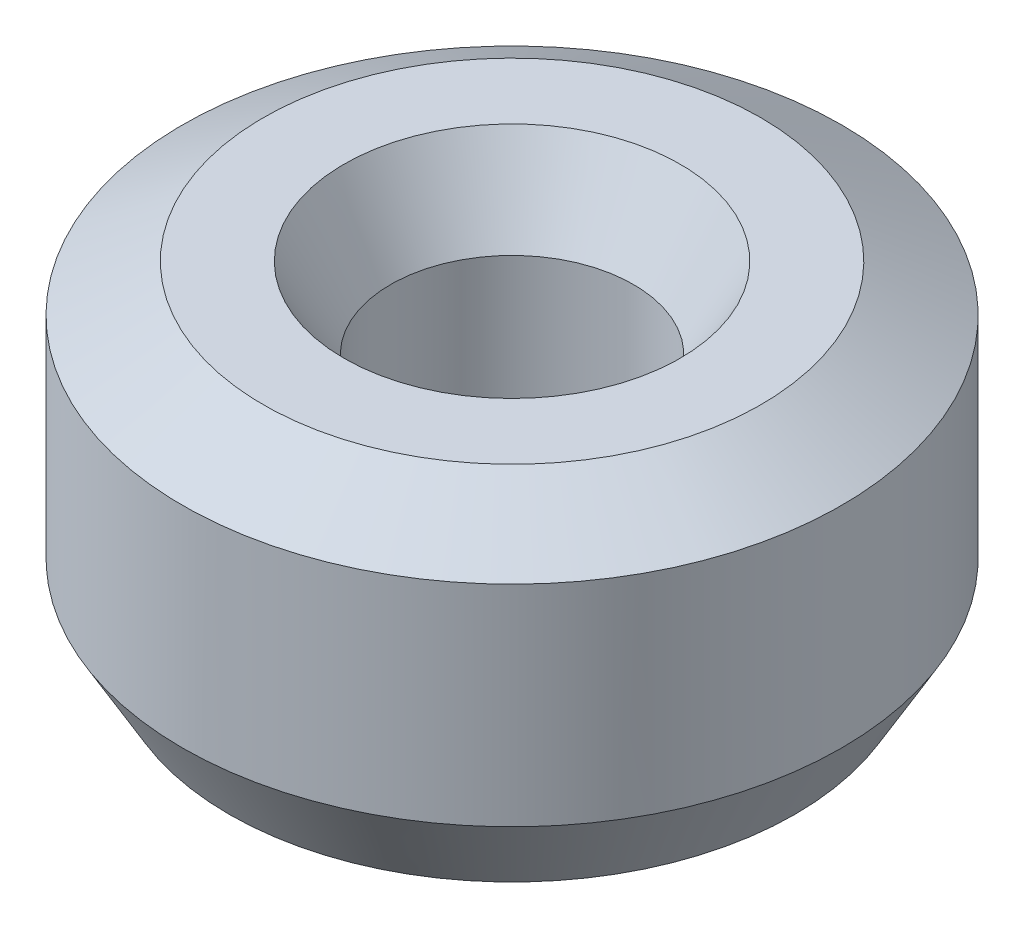
ISO-10303-21;
HEADER;
FILE_DESCRIPTION(('STEP AP214'),'2;1');
FILE_NAME('part.step','',(''),(''),'','','');
FILE_SCHEMA(('AUTOMOTIVE_DESIGN { 1 0 10303 214 1 1 1 1 }'));
ENDSEC;
DATA;
#1=APPLICATION_CONTEXT('core data for automotive mechanical design processes');
#2=APPLICATION_PROTOCOL_DEFINITION('international standard','automotive_design',2000,#1);
#3=PRODUCT_CONTEXT('',#1,'mechanical');
#4=PRODUCT('Part','Part','',(#3));
#5=PRODUCT_RELATED_PRODUCT_CATEGORY('part','',(#4));
#6=PRODUCT_DEFINITION_FORMATION('','',#4);
#7=PRODUCT_DEFINITION_CONTEXT('part definition',#1,'design');
#8=PRODUCT_DEFINITION('design','',#6,#7);
#9=PRODUCT_DEFINITION_SHAPE('','',#8);
#10=(LENGTH_UNIT() NAMED_UNIT(*) SI_UNIT(.MILLI.,.METRE.));
#11=(NAMED_UNIT(*) PLANE_ANGLE_UNIT() SI_UNIT($,.RADIAN.));
#12=(NAMED_UNIT(*) SI_UNIT($,.STERADIAN.) SOLID_ANGLE_UNIT());
#13=UNCERTAINTY_MEASURE_WITH_UNIT(LENGTH_MEASURE(1.E-05),#10,'distance_accuracy_value','');
#14=(GEOMETRIC_REPRESENTATION_CONTEXT(3) GLOBAL_UNCERTAINTY_ASSIGNED_CONTEXT((#13)) GLOBAL_UNIT_ASSIGNED_CONTEXT((#10,
#11,#12)) REPRESENTATION_CONTEXT('',''));
#15=CARTESIAN_POINT('',(0.,0.,0.));
#16=DIRECTION('',(0.,0.,1.));
#17=DIRECTION('',(1.,0.,0.));
#18=AXIS2_PLACEMENT_3D('',#15,#16,#17);
#19=CARTESIAN_POINT('',(0.,12.8059269749935,0.));
#20=DIRECTION('',(0.,-1.,0.));
#21=DIRECTION('',(0.,0.,-1.));
#22=AXIS2_PLACEMENT_3D('',#19,#20,#21);
#23=CYLINDRICAL_SURFACE('',#22,12.5);
#24=CARTESIAN_POINT('',(0.,3.06635680657823,0.));
#25=DIRECTION('',(0.,1.,0.));
#26=DIRECTION('',(0.,0.,1.));
#27=AXIS2_PLACEMENT_3D('',#24,#25,#26);
#28=CIRCLE('',#27,12.5);
#29=CARTESIAN_POINT('',(0.,3.06635680657823,12.5));
#30=VERTEX_POINT('',#29);
#31=EDGE_CURVE('E10',#30,#30,#28,.T.);
#32=ORIENTED_EDGE('',*,*,#31,.T.);
#33=EDGE_LOOP('',(#32));
#34=FACE_BOUND('',#33,.T.);
#35=CARTESIAN_POINT('',(0.,11.0355650472841,0.));
#36=DIRECTION('',(0.,1.,0.));
#37=DIRECTION('',(0.,0.,1.));
#38=AXIS2_PLACEMENT_3D('',#35,#36,#37);
#39=CIRCLE('',#38,12.5);
#40=CARTESIAN_POINT('',(0.,11.0355650472841,-12.5));
#41=VERTEX_POINT('',#40);
#42=EDGE_CURVE('E50',#41,#41,#39,.F.);
#43=ORIENTED_EDGE('',*,*,#42,.T.);
#44=EDGE_LOOP('',(#43));
#45=FACE_BOUND('',#44,.T.);
#46=ADVANCED_FACE('F39',(#34,#45),#23,.T.);
#47=CARTESIAN_POINT('',(0.,12.8059269749935,0.));
#48=DIRECTION('',(0.,1.,0.));
#49=DIRECTION('',(0.,0.,1.));
#50=AXIS2_PLACEMENT_3D('',#47,#48,#49);
#51=PLANE('',#50);
#52=CARTESIAN_POINT('',(0.,12.8059269749935,0.));
#53=DIRECTION('',(0.,1.,0.));
#54=DIRECTION('',(0.,0.,1.));
#55=AXIS2_PLACEMENT_3D('',#52,#53,#54);
#56=CIRCLE('',#55,6.37682754445808);
#57=CARTESIAN_POINT('',(0.,12.8059269749935,6.37682754445808));
#58=VERTEX_POINT('',#57);
#59=EDGE_CURVE('E58',#58,#58,#56,.F.);
#60=ORIENTED_EDGE('',*,*,#59,.T.);
#61=EDGE_LOOP('',(#60));
#62=FACE_BOUND('',#61,.T.);
#63=CARTESIAN_POINT('',(0.,12.8059269749935,0.));
#64=DIRECTION('',(0.,1.,0.));
#65=DIRECTION('',(0.,0.,1.));
#66=AXIS2_PLACEMENT_3D('',#63,#64,#65);
#67=CIRCLE('',#66,9.43364319342179);
#68=CARTESIAN_POINT('',(0.,12.8059269749935,-9.43364319342179));
#69=VERTEX_POINT('',#68);
#70=EDGE_CURVE('E61',#69,#69,#67,.T.);
#71=ORIENTED_EDGE('',*,*,#70,.T.);
#72=EDGE_LOOP('',(#71));
#73=FACE_BOUND('',#72,.T.);
#74=ADVANCED_FACE('F88',(#62,#73),#51,.T.);
#75=CARTESIAN_POINT('',(0.,0.,0.));
#76=DIRECTION('',(0.,1.,0.));
#77=DIRECTION('',(0.,0.,1.));
#78=AXIS2_PLACEMENT_3D('',#75,#76,#77);
#79=PLANE('',#78);
#80=CARTESIAN_POINT('',(0.,0.,0.));
#81=DIRECTION('',(0.,1.,0.));
#82=DIRECTION('',(0.,0.,1.));
#83=AXIS2_PLACEMENT_3D('',#80,#81,#82);
#84=CIRCLE('',#83,7.67282242332691);
#85=CARTESIAN_POINT('',(0.,0.,7.67282242332691));
#86=VERTEX_POINT('',#85);
#87=EDGE_CURVE('E51',#86,#86,#84,.T.);
#88=ORIENTED_EDGE('',*,*,#87,.T.);
#89=EDGE_LOOP('',(#88));
#90=FACE_BOUND('',#89,.T.);
#91=CARTESIAN_POINT('',(0.,0.,0.));
#92=DIRECTION('',(0.,1.,0.));
#93=DIRECTION('',(0.,0.,1.));
#94=AXIS2_PLACEMENT_3D('',#91,#92,#93);
#95=CIRCLE('',#94,10.7296380722906);
#96=CARTESIAN_POINT('',(0.,0.,10.7296380722906));
#97=VERTEX_POINT('',#96);
#98=EDGE_CURVE('E54',#97,#97,#95,.F.);
#99=ORIENTED_EDGE('',*,*,#98,.T.);
#100=EDGE_LOOP('',(#99));
#101=FACE_BOUND('',#100,.T.);
#102=ADVANCED_FACE('F83',(#90,#101),#79,.F.);
#103=CARTESIAN_POINT('',(0.,12.8059269749935,0.));
#104=DIRECTION('',(0.,-1.,0.));
#105=DIRECTION('',(0.,0.,-1.));
#106=AXIS2_PLACEMENT_3D('',#103,#104,#105);
#107=CYLINDRICAL_SURFACE('',#106,4.60646561674868);
#108=CARTESIAN_POINT('',(0.,9.7395701684153,0.));
#109=DIRECTION('',(0.,1.,0.));
#110=DIRECTION('',(0.,0.,1.));
#111=AXIS2_PLACEMENT_3D('',#108,#109,#110);
#112=CIRCLE('',#111,4.60646561674868);
#113=CARTESIAN_POINT('',(0.,9.7395701684153,4.60646561674868));
#114=VERTEX_POINT('',#113);
#115=EDGE_CURVE('E67',#114,#114,#112,.T.);
#116=ORIENTED_EDGE('',*,*,#115,.T.);
#117=EDGE_LOOP('',(#116));
#118=FACE_BOUND('',#117,.T.);
#119=CARTESIAN_POINT('',(0.,1.7703619277094,0.));
#120=DIRECTION('',(0.,1.,0.));
#121=DIRECTION('',(0.,0.,1.));
#122=AXIS2_PLACEMENT_3D('',#119,#120,#121);
#123=CIRCLE('',#122,4.60646561674868);
#124=CARTESIAN_POINT('',(0.,1.7703619277094,4.60646561674868));
#125=VERTEX_POINT('',#124);
#126=EDGE_CURVE('E69',#125,#125,#123,.F.);
#127=ORIENTED_EDGE('',*,*,#126,.T.);
#128=EDGE_LOOP('',(#127));
#129=FACE_BOUND('',#128,.T.);
#130=ADVANCED_FACE('F71',(#118,#129),#107,.F.);
#131=CARTESIAN_POINT('',(0.,9.7395701684153,0.));
#132=DIRECTION('',(0.,1.,0.));
#133=DIRECTION('',(0.,0.,1.));
#134=AXIS2_PLACEMENT_3D('',#131,#132,#133);
#135=CONICAL_SURFACE('',#134,4.60646561674868,0.523598775598302);
#136=CARTESIAN_POINT('',(0.,12.8059269749935,6.37682754445808));
#137=CARTESIAN_POINT('',(0.,12.7739857582583,6.35838627437777));
#138=CARTESIAN_POINT('',(0.,12.7420445415232,6.33994500429747));
#139=CARTESIAN_POINT('',(0.,12.6781621080528,6.30306246413686));
#140=CARTESIAN_POINT('',(0.,12.6462208913176,6.28462119405655));
#141=CARTESIAN_POINT('',(0.,12.5823384578472,6.24773865389594));
#142=CARTESIAN_POINT('',(0.,12.550397241112,6.22929738381563));
#143=CARTESIAN_POINT('',(0.,12.4865148076416,6.19241484365502));
#144=CARTESIAN_POINT('',(0.,12.4545735909064,6.17397357357471));
#145=CARTESIAN_POINT('',(0.,12.3906911574361,6.1370910334141));
#146=CARTESIAN_POINT('',(0.,12.3587499407009,6.11864976333379));
#147=CARTESIAN_POINT('',(0.,12.2948675072305,6.08176722317318));
#148=CARTESIAN_POINT('',(0.,12.2629262904953,6.06332595309287));
#149=CARTESIAN_POINT('',(0.,12.1990438570249,6.02644341293226));
#150=CARTESIAN_POINT('',(0.,12.1671026402897,6.00800214285196));
#151=CARTESIAN_POINT('',(0.,12.1032202068194,5.97111960269134));
#152=CARTESIAN_POINT('',(0.,12.0712789900842,5.95267833261104));
#153=CARTESIAN_POINT('',(0.,12.0073965566138,5.91579579245042));
#154=CARTESIAN_POINT('',(0.,11.9754553398786,5.89735452237012));
#155=CARTESIAN_POINT('',(0.,11.9115729064082,5.86047198220951));
#156=CARTESIAN_POINT('',(0.,11.879631689673,5.8420307121292));
#157=CARTESIAN_POINT('',(0.,11.8157492562026,5.80514817196859));
#158=CARTESIAN_POINT('',(0.,11.7838080394675,5.78670690188828));
#159=CARTESIAN_POINT('',(0.,11.7199256059971,5.74982436172767));
#160=CARTESIAN_POINT('',(0.,11.6879843892619,5.73138309164736));
#161=CARTESIAN_POINT('',(0.,11.6241019557915,5.69450055148675));
#162=CARTESIAN_POINT('',(0.,11.5921607390563,5.67605928140644));
#163=CARTESIAN_POINT('',(0.,11.5282783055859,5.63917674124583));
#164=CARTESIAN_POINT('',(0.,11.4963370888507,5.62073547116553));
#165=CARTESIAN_POINT('',(0.,11.4324546553804,5.58385293100491));
#166=CARTESIAN_POINT('',(0.,11.4005134386452,5.56541166092461));
#167=CARTESIAN_POINT('',(0.,11.3366310051748,5.52852912076399));
#168=CARTESIAN_POINT('',(0.,11.3046897884396,5.51008785068369));
#169=CARTESIAN_POINT('',(0.,11.2408073549692,5.47320531052307));
#170=CARTESIAN_POINT('',(0.,11.208866138234,5.45476404044277));
#171=CARTESIAN_POINT('',(0.,11.1449837047637,5.41788150028216));
#172=CARTESIAN_POINT('',(0.,11.1130424880285,5.39944023020185));
#173=CARTESIAN_POINT('',(0.,11.0491600545581,5.36255769004124));
#174=CARTESIAN_POINT('',(0.,11.0172188378229,5.34411641996093));
#175=CARTESIAN_POINT('',(0.,10.9533364043525,5.30723387980032));
#176=CARTESIAN_POINT('',(0.,10.9213951876173,5.28879260972001));
#177=CARTESIAN_POINT('',(0.,10.8575127541469,5.2519100695594));
#178=CARTESIAN_POINT('',(0.,10.8255715374118,5.23346879947909));
#179=CARTESIAN_POINT('',(0.,10.7616891039414,5.19658625931848));
#180=CARTESIAN_POINT('',(0.,10.7297478872062,5.17814498923817));
#181=CARTESIAN_POINT('',(0.,10.6658654537358,5.14126244907756));
#182=CARTESIAN_POINT('',(0.,10.6339242370006,5.12282117899726));
#183=CARTESIAN_POINT('',(0.,10.5700418035302,5.08593863883664));
#184=CARTESIAN_POINT('',(0.,10.538100586795,5.06749736875634));
#185=CARTESIAN_POINT('',(0.,10.4742181533247,5.03061482859573));
#186=CARTESIAN_POINT('',(0.,10.4422769365895,5.01217355851542));
#187=CARTESIAN_POINT('',(0.,10.3783945031191,4.97529101835481));
#188=CARTESIAN_POINT('',(0.,10.3464532863839,4.9568497482745));
#189=CARTESIAN_POINT('',(0.,10.2825708529135,4.91996720811389));
#190=CARTESIAN_POINT('',(0.,10.2506296361783,4.90152593803358));
#191=CARTESIAN_POINT('',(0.,10.186747202708,4.86464339787297));
#192=CARTESIAN_POINT('',(0.,10.1548059859728,4.84620212779266));
#193=CARTESIAN_POINT('',(0.,10.0909235525024,4.80931958763205));
#194=CARTESIAN_POINT('',(0.,10.0589823357672,4.79087831755174));
#195=CARTESIAN_POINT('',(0.,9.99509990229682,4.75399577739113));
#196=CARTESIAN_POINT('',(0.,9.96315868556163,4.73555450731083));
#197=CARTESIAN_POINT('',(0.,9.89927625209125,4.69867196715021));
#198=CARTESIAN_POINT('',(0.,9.86733503535606,4.68023069706991));
#199=CARTESIAN_POINT('',(0.,9.80345260188568,4.64334815690929));
#200=CARTESIAN_POINT('',(0.,9.77151138515049,4.62490688682899));
#201=CARTESIAN_POINT('',(0.,9.7395701684153,4.60646561674868));
#202=B_SPLINE_CURVE_WITH_KNOTS('',3,(#136,#137,#138,#139,#140,#141,#142,#143,#144,#145,#146,
#147,#148,#149,#150,#151,#152,#153,#154,#155,#156,#157,#158,#159,#160,#161,#162,#163,#164,#165,
#166,#167,#168,#169,#170,#171,#172,#173,#174,#175,#176,#177,#178,#179,#180,#181,#182,#183,#184,
#185,#186,#187,#188,#189,#190,#191,#192,#193,#194,#195,#196,#197,#198,#199,#200,#201),
.UNSPECIFIED.,.F.,.F.,(4,2,2,2,2,2,2,2,2,2,2,2,2,2,2,2,2,2,2,2,2,2,2,2,2,2,2,2,2,2,2,2,4),(0.,
0.110647620481837,0.221295240963674,0.331942861445511,0.442590481927348,0.553238102409184,
0.663885722891022,0.774533343372859,0.885180963854696,0.995828584336532,1.10647620481837,
1.2171238253002,1.32777144578204,1.43841906626388,1.54906668674572,1.65971430722755,
1.77036192770939,1.88100954819123,1.99165716867306,2.1023047891549,2.21295240963674,
2.32360003011857,2.43424765060041,2.54489527108225,2.65554289156408,2.76619051204592,
2.87683813252776,2.98748575300959,3.09813337349143,3.20878099397327,3.31942861445511,
3.43007623493694,3.54072385541878),.UNSPECIFIED.);
#203=EDGE_CURVE('BSEAM77',#58,#114,#202,.T.);
#204=ORIENTED_EDGE('',*,*,#59,.F.);
#205=ORIENTED_EDGE('',*,*,#115,.F.);
#206=ORIENTED_EDGE('',*,*,#203,.T.);
#207=ORIENTED_EDGE('',*,*,#203,.F.);
#208=EDGE_LOOP('',(#204,#206,#205,#207));
#209=FACE_BOUND('',#208,.T.);
#210=ADVANCED_FACE('F77',(#209),#135,.F.);
#211=CARTESIAN_POINT('',(0.,0.,0.));
#212=DIRECTION('',(0.,-1.,0.));
#213=DIRECTION('',(0.,0.,-1.));
#214=AXIS2_PLACEMENT_3D('',#211,#212,#213);
#215=CONICAL_SURFACE('',#214,7.67282242332691,1.04719755119659);
#216=ORIENTED_EDGE('',*,*,#126,.F.);
#217=EDGE_LOOP('',(#216));
#218=FACE_BOUND('',#217,.T.);
#219=ORIENTED_EDGE('',*,*,#87,.F.);
#220=EDGE_LOOP('',(#219));
#221=FACE_BOUND('',#220,.T.);
#222=ADVANCED_FACE('F73',(#218,#221),#215,.F.);
#223=CARTESIAN_POINT('',(0.,3.06635680657823,0.));
#224=DIRECTION('',(0.,1.,0.));
#225=DIRECTION('',(0.,0.,1.));
#226=AXIS2_PLACEMENT_3D('',#223,#224,#225);
#227=CONICAL_SURFACE('',#226,12.5,0.523598775598302);
#228=ORIENTED_EDGE('',*,*,#98,.F.);
#229=EDGE_LOOP('',(#228));
#230=FACE_BOUND('',#229,.T.);
#231=ORIENTED_EDGE('',*,*,#31,.F.);
#232=EDGE_LOOP('',(#231));
#233=FACE_BOUND('',#232,.T.);
#234=ADVANCED_FACE('F76',(#230,#233),#227,.T.);
#235=CARTESIAN_POINT('',(0.,12.8059269749935,0.));
#236=DIRECTION('',(0.,-1.,0.));
#237=DIRECTION('',(0.,0.,-1.));
#238=AXIS2_PLACEMENT_3D('',#235,#236,#237);
#239=CONICAL_SURFACE('',#238,9.43364319342179,1.04719755119659);
#240=CARTESIAN_POINT('',(0.,11.0355650472841,-12.5));
#241=CARTESIAN_POINT('',(0.,11.0540063173644,-12.4680587832648));
#242=CARTESIAN_POINT('',(0.,11.0724475874448,-12.4361175665296));
#243=CARTESIAN_POINT('',(0.,11.1093301276054,-12.3722351330592));
#244=CARTESIAN_POINT('',(0.,11.1277713976857,-12.3402939163241));
#245=CARTESIAN_POINT('',(0.,11.1646539378463,-12.2764114828537));
#246=CARTESIAN_POINT('',(0.,11.1830952079266,-12.2444702661185));
#247=CARTESIAN_POINT('',(0.,11.2199777480872,-12.1805878326481));
#248=CARTESIAN_POINT('',(0.,11.2384190181675,-12.1486466159129));
#249=CARTESIAN_POINT('',(0.,11.2753015583281,-12.0847641824425));
#250=CARTESIAN_POINT('',(0.,11.2937428284084,-12.0528229657073));
#251=CARTESIAN_POINT('',(0.,11.330625368569,-11.988940532237));
#252=CARTESIAN_POINT('',(0.,11.3490666386493,-11.9569993155018));
#253=CARTESIAN_POINT('',(0.,11.38594917881,-11.8931168820314));
#254=CARTESIAN_POINT('',(0.,11.4043904488903,-11.8611756652962));
#255=CARTESIAN_POINT('',(0.,11.4412729890509,-11.7972932318258));
#256=CARTESIAN_POINT('',(0.,11.4597142591312,-11.7653520150906));
#257=CARTESIAN_POINT('',(0.,11.4965967992918,-11.7014695816203));
#258=CARTESIAN_POINT('',(0.,11.5150380693721,-11.6695283648851));
#259=CARTESIAN_POINT('',(0.,11.5519206095327,-11.6056459314147));
#260=CARTESIAN_POINT('',(0.,11.570361879613,-11.5737047146795));
#261=CARTESIAN_POINT('',(0.,11.6072444197736,-11.5098222812091));
#262=CARTESIAN_POINT('',(0.,11.6256856898539,-11.4778810644739));
#263=CARTESIAN_POINT('',(0.,11.6625682300145,-11.4139986310036));
#264=CARTESIAN_POINT('',(0.,11.6810095000949,-11.3820574142684));
#265=CARTESIAN_POINT('',(0.,11.7178920402555,-11.318174980798));
#266=CARTESIAN_POINT('',(0.,11.7363333103358,-11.2862337640628));
#267=CARTESIAN_POINT('',(0.,11.7732158504964,-11.2223513305924));
#268=CARTESIAN_POINT('',(0.,11.7916571205767,-11.1904101138572));
#269=CARTESIAN_POINT('',(0.,11.8285396607373,-11.1265276803868));
#270=CARTESIAN_POINT('',(0.,11.8469809308176,-11.0945864636517));
#271=CARTESIAN_POINT('',(0.,11.8838634709782,-11.0307040301813));
#272=CARTESIAN_POINT('',(0.,11.9023047410585,-10.9987628134461));
#273=CARTESIAN_POINT('',(0.,11.9391872812191,-10.9348803799757));
#274=CARTESIAN_POINT('',(0.,11.9576285512995,-10.9029391632405));
#275=CARTESIAN_POINT('',(0.,11.9945110914601,-10.8390567297701));
#276=CARTESIAN_POINT('',(0.,12.0129523615404,-10.8071155130349));
#277=CARTESIAN_POINT('',(0.,12.049834901701,-10.7432330795646));
#278=CARTESIAN_POINT('',(0.,12.0682761717813,-10.7112918628294));
#279=CARTESIAN_POINT('',(0.,12.1051587119419,-10.647409429359));
#280=CARTESIAN_POINT('',(0.,12.1235999820222,-10.6154682126238));
#281=CARTESIAN_POINT('',(0.,12.1604825221828,-10.5515857791534));
#282=CARTESIAN_POINT('',(0.,12.1789237922631,-10.5196445624182));
#283=CARTESIAN_POINT('',(0.,12.2158063324237,-10.4557621289479));
#284=CARTESIAN_POINT('',(0.,12.234247602504,-10.4238209122127));
#285=CARTESIAN_POINT('',(0.,12.2711301426647,-10.3599384787423));
#286=CARTESIAN_POINT('',(0.,12.289571412745,-10.3279972620071));
#287=CARTESIAN_POINT('',(0.,12.3264539529056,-10.2641148285367));
#288=CARTESIAN_POINT('',(0.,12.3448952229859,-10.2321736118015));
#289=CARTESIAN_POINT('',(0.,12.3817777631465,-10.1682911783312));
#290=CARTESIAN_POINT('',(0.,12.4002190332268,-10.136349961596));
#291=CARTESIAN_POINT('',(0.,12.4371015733874,-10.0724675281256));
#292=CARTESIAN_POINT('',(0.,12.4555428434677,-10.0405263113904));
#293=CARTESIAN_POINT('',(0.,12.4924253836283,-9.97664387792002));
#294=CARTESIAN_POINT('',(0.,12.5108666537086,-9.94470266118483));
#295=CARTESIAN_POINT('',(0.,12.5477491938692,-9.88082022771445));
#296=CARTESIAN_POINT('',(0.,12.5661904639496,-9.84887901097926));
#297=CARTESIAN_POINT('',(0.,12.6030730041102,-9.78499657750888));
#298=CARTESIAN_POINT('',(0.,12.6215142741905,-9.75305536077369));
#299=CARTESIAN_POINT('',(0.,12.6583968143511,-9.68917292730331));
#300=CARTESIAN_POINT('',(0.,12.6768380844314,-9.65723171056812));
#301=CARTESIAN_POINT('',(0.,12.713720624592,-9.59334927709774));
#302=CARTESIAN_POINT('',(0.,12.7321618946723,-9.56140806036255));
#303=CARTESIAN_POINT('',(0.,12.7690444348329,-9.49752562689217));
#304=CARTESIAN_POINT('',(0.,12.7874857049132,-9.46558441015698));
#305=CARTESIAN_POINT('',(0.,12.8059269749935,-9.43364319342179));
#306=B_SPLINE_CURVE_WITH_KNOTS('',3,(#240,#241,#242,#243,#244,#245,#246,#247,#248,#249,#250,
#251,#252,#253,#254,#255,#256,#257,#258,#259,#260,#261,#262,#263,#264,#265,#266,#267,#268,#269,
#270,#271,#272,#273,#274,#275,#276,#277,#278,#279,#280,#281,#282,#283,#284,#285,#286,#287,#288,
#289,#290,#291,#292,#293,#294,#295,#296,#297,#298,#299,#300,#301,#302,#303,#304,#305),
.UNSPECIFIED.,.F.,.F.,(4,2,2,2,2,2,2,2,2,2,2,2,2,2,2,2,2,2,2,2,2,2,2,2,2,2,2,2,2,2,2,2,4),(0.,
0.110647620481837,0.221295240963674,0.33194286144551,0.442590481927344,0.553238102409182,
0.663885722891017,0.774533343372854,0.885180963854689,0.995828584336525,1.10647620481836,
1.2171238253002,1.32777144578203,1.43841906626387,1.54906668674571,1.65971430722754,
1.77036192770938,1.88100954819121,1.99165716867305,2.10230478915488,2.21295240963672,
2.32360003011856,2.43424765060039,2.54489527108223,2.65554289156407,2.7661905120459,
2.87683813252774,2.98748575300957,3.09813337349141,3.20878099397324,3.31942861445508,
3.43007623493692,3.54072385541875),.UNSPECIFIED.);
#307=EDGE_CURVE('BSEAM45',#41,#69,#306,.T.);
#308=ORIENTED_EDGE('',*,*,#42,.F.);
#309=ORIENTED_EDGE('',*,*,#70,.F.);
#310=ORIENTED_EDGE('',*,*,#307,.T.);
#311=ORIENTED_EDGE('',*,*,#307,.F.);
#312=EDGE_LOOP('',(#308,#310,#309,#311));
#313=FACE_BOUND('',#312,.T.);
#314=ADVANCED_FACE('F45',(#313),#239,.T.);
#315=CLOSED_SHELL('',(#46,#74,#102,#130,#210,#222,#234,#314));
#316=MANIFOLD_SOLID_BREP('B2',#315);
#317=ADVANCED_BREP_SHAPE_REPRESENTATION('',(#18,#316),#14);
#318=SHAPE_DEFINITION_REPRESENTATION(#9,#317);
ENDSEC;
END-ISO-10303-21;
